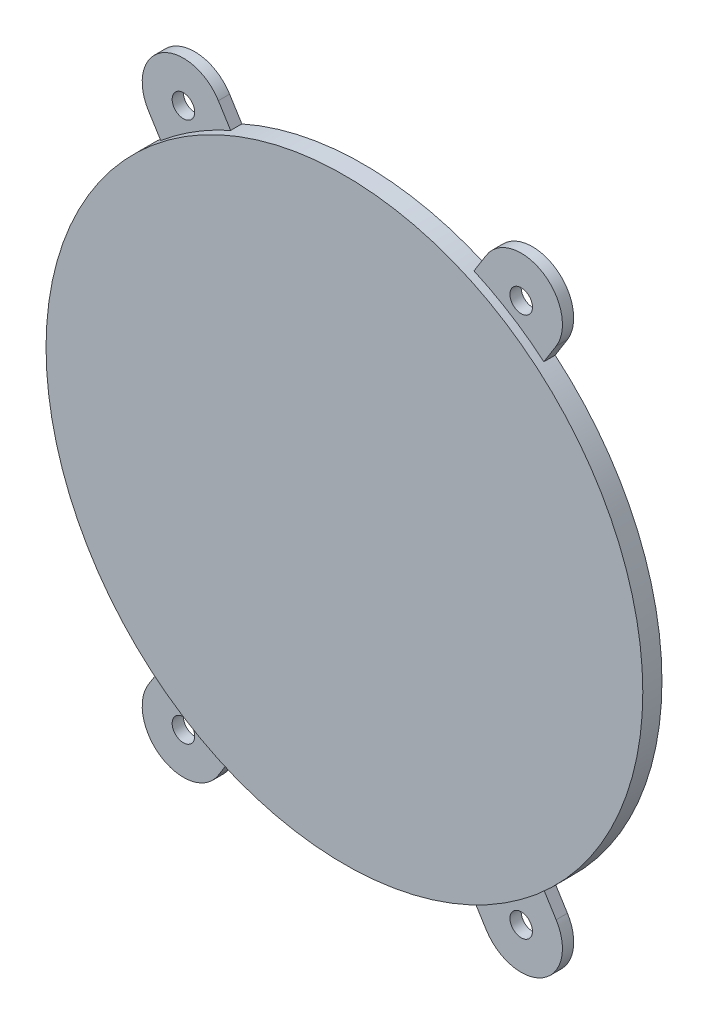
ISO-10303-21;
HEADER;
FILE_DESCRIPTION(('STEP AP214'),'2;1');
FILE_NAME('part.step','',(''),(''),'','','');
FILE_SCHEMA(('AUTOMOTIVE_DESIGN { 1 0 10303 214 1 1 1 1 }'));
ENDSEC;
DATA;
#1=APPLICATION_CONTEXT('core data for automotive mechanical design processes');
#2=APPLICATION_PROTOCOL_DEFINITION('international standard','automotive_design',2000,#1);
#3=PRODUCT_CONTEXT('',#1,'mechanical');
#4=PRODUCT('Part','Part','',(#3));
#5=PRODUCT_RELATED_PRODUCT_CATEGORY('part','',(#4));
#6=PRODUCT_DEFINITION_FORMATION('','',#4);
#7=PRODUCT_DEFINITION_CONTEXT('part definition',#1,'design');
#8=PRODUCT_DEFINITION('design','',#6,#7);
#9=PRODUCT_DEFINITION_SHAPE('','',#8);
#10=(LENGTH_UNIT() NAMED_UNIT(*) SI_UNIT(.MILLI.,.METRE.));
#11=(NAMED_UNIT(*) PLANE_ANGLE_UNIT() SI_UNIT($,.RADIAN.));
#12=(NAMED_UNIT(*) SI_UNIT($,.STERADIAN.) SOLID_ANGLE_UNIT());
#13=UNCERTAINTY_MEASURE_WITH_UNIT(LENGTH_MEASURE(1.E-05),#10,'distance_accuracy_value','');
#14=(GEOMETRIC_REPRESENTATION_CONTEXT(3) GLOBAL_UNCERTAINTY_ASSIGNED_CONTEXT((#13)) GLOBAL_UNIT_ASSIGNED_CONTEXT((#10,
#11,#12)) REPRESENTATION_CONTEXT('',''));
#15=CARTESIAN_POINT('',(0.,0.,0.));
#16=DIRECTION('',(0.,0.,1.));
#17=DIRECTION('',(1.,0.,0.));
#18=AXIS2_PLACEMENT_3D('',#15,#16,#17);
#19=CARTESIAN_POINT('',(0.,0.,1.7));
#20=DIRECTION('',(0.,0.,-1.));
#21=DIRECTION('',(-1.,0.,0.));
#22=AXIS2_PLACEMENT_3D('',#19,#20,#21);
#23=CYLINDRICAL_SURFACE('',#22,26.5);
#24=CARTESIAN_POINT('',(0.,0.,1.7));
#25=DIRECTION('',(0.,0.,1.));
#26=DIRECTION('',(1.,0.,0.));
#27=AXIS2_PLACEMENT_3D('',#24,#25,#26);
#28=CIRCLE('',#27,26.5);
#29=CARTESIAN_POINT('',(26.5,0.,1.7));
#30=VERTEX_POINT('',#29);
#31=EDGE_CURVE('E307',#30,#30,#28,.T.);
#32=ORIENTED_EDGE('',*,*,#31,.F.);
#33=EDGE_LOOP('',(#32));
#34=FACE_BOUND('',#33,.T.);
#35=DIRECTION('',(0.,0.,-1.));
#36=VECTOR('',#35,1.);
#37=CARTESIAN_POINT('',(10.8059111562678,-24.1967411872518,1.7));
#38=LINE('',#37,#36);
#39=CARTESIAN_POINT('',(10.8059111562678,-24.1967411872518,1.));
#40=VERTEX_POINT('',#39);
#41=CARTESIAN_POINT('',(10.8059111562678,-24.1967411872518,0.));
#42=VERTEX_POINT('',#41);
#43=EDGE_CURVE('E103',#40,#42,#38,.T.);
#44=ORIENTED_EDGE('',*,*,#43,.F.);
#45=CARTESIAN_POINT('',(0.,0.,1.));
#46=DIRECTION('',(0.,0.,1.));
#47=DIRECTION('',(1.,0.,0.));
#48=AXIS2_PLACEMENT_3D('',#45,#46,#47);
#49=CIRCLE('',#48,26.5);
#50=CARTESIAN_POINT('',(17.0147051672551,-20.3162449303847,1.));
#51=VERTEX_POINT('',#50);
#52=EDGE_CURVE('E12',#40,#51,#49,.T.);
#53=ORIENTED_EDGE('',*,*,#52,.T.);
#54=DIRECTION('',(0.,0.,-1.));
#55=VECTOR('',#54,1.);
#56=CARTESIAN_POINT('',(17.0147051672551,-20.3162449303847,1.7));
#57=LINE('',#56,#55);
#58=CARTESIAN_POINT('',(17.0147051672551,-20.3162449303847,0.));
#59=VERTEX_POINT('',#58);
#60=EDGE_CURVE('E225',#51,#59,#57,.T.);
#61=ORIENTED_EDGE('',*,*,#60,.T.);
#62=CARTESIAN_POINT('',(0.,0.,0.));
#63=DIRECTION('',(0.,0.,1.));
#64=DIRECTION('',(1.,0.,0.));
#65=AXIS2_PLACEMENT_3D('',#62,#63,#64);
#66=CIRCLE('',#65,26.5);
#67=CARTESIAN_POINT('',(17.0147051672551,20.3162449303847,0.));
#68=VERTEX_POINT('',#67);
#69=EDGE_CURVE('E314',#59,#68,#66,.T.);
#70=ORIENTED_EDGE('',*,*,#69,.T.);
#71=DIRECTION('',(0.,0.,-1.));
#72=VECTOR('',#71,1.);
#73=CARTESIAN_POINT('',(17.0147051672551,20.3162449303847,1.7));
#74=LINE('',#73,#72);
#75=CARTESIAN_POINT('',(17.0147051672551,20.3162449303847,1.));
#76=VERTEX_POINT('',#75);
#77=EDGE_CURVE('E277',#76,#68,#74,.T.);
#78=ORIENTED_EDGE('',*,*,#77,.F.);
#79=CARTESIAN_POINT('',(0.,0.,1.));
#80=DIRECTION('',(0.,0.,1.));
#81=DIRECTION('',(1.,0.,0.));
#82=AXIS2_PLACEMENT_3D('',#79,#80,#81);
#83=CIRCLE('',#82,26.5);
#84=CARTESIAN_POINT('',(10.8059111562678,24.1967411872518,1.));
#85=VERTEX_POINT('',#84);
#86=EDGE_CURVE('E316',#76,#85,#83,.T.);
#87=ORIENTED_EDGE('',*,*,#86,.T.);
#88=DIRECTION('',(0.,0.,-1.));
#89=VECTOR('',#88,1.);
#90=CARTESIAN_POINT('',(10.8059111562678,24.1967411872518,1.7));
#91=LINE('',#90,#89);
#92=CARTESIAN_POINT('',(10.8059111562678,24.1967411872518,0.));
#93=VERTEX_POINT('',#92);
#94=EDGE_CURVE('E266',#85,#93,#91,.T.);
#95=ORIENTED_EDGE('',*,*,#94,.T.);
#96=CARTESIAN_POINT('',(-10.8059111562678,24.1967411872518,0.));
#97=VERTEX_POINT('',#96);
#98=EDGE_CURVE('E306',#93,#97,#66,.T.);
#99=ORIENTED_EDGE('',*,*,#98,.T.);
#100=DIRECTION('',(0.,0.,-1.));
#101=VECTOR('',#100,1.);
#102=CARTESIAN_POINT('',(-10.8059111562678,24.1967411872518,1.7));
#103=LINE('',#102,#101);
#104=CARTESIAN_POINT('',(-10.8059111562678,24.1967411872518,1.));
#105=VERTEX_POINT('',#104);
#106=EDGE_CURVE('E304',#97,#105,#103,.F.);
#107=ORIENTED_EDGE('',*,*,#106,.T.);
#108=CARTESIAN_POINT('',(0.,0.,1.));
#109=DIRECTION('',(0.,0.,1.));
#110=DIRECTION('',(1.,0.,0.));
#111=AXIS2_PLACEMENT_3D('',#108,#109,#110);
#112=CIRCLE('',#111,26.5);
#113=CARTESIAN_POINT('',(-17.0147051672551,20.3162449303847,1.));
#114=VERTEX_POINT('',#113);
#115=EDGE_CURVE('E310',#105,#114,#112,.T.);
#116=ORIENTED_EDGE('',*,*,#115,.T.);
#117=DIRECTION('',(0.,0.,-1.));
#118=VECTOR('',#117,1.);
#119=CARTESIAN_POINT('',(-17.0147051672551,20.3162449303847,1.7));
#120=LINE('',#119,#118);
#121=CARTESIAN_POINT('',(-17.0147051672551,20.3162449303847,0.));
#122=VERTEX_POINT('',#121);
#123=EDGE_CURVE('E301',#122,#114,#120,.F.);
#124=ORIENTED_EDGE('',*,*,#123,.F.);
#125=CARTESIAN_POINT('',(-17.0147051672551,-20.3162449303847,0.));
#126=VERTEX_POINT('',#125);
#127=EDGE_CURVE('E311',#122,#126,#66,.T.);
#128=ORIENTED_EDGE('',*,*,#127,.T.);
#129=DIRECTION('',(0.,0.,-1.));
#130=VECTOR('',#129,1.);
#131=CARTESIAN_POINT('',(-17.0147051672551,-20.3162449303847,1.7));
#132=LINE('',#131,#130);
#133=CARTESIAN_POINT('',(-17.0147051672551,-20.3162449303847,1.));
#134=VERTEX_POINT('',#133);
#135=EDGE_CURVE('E252',#126,#134,#132,.F.);
#136=ORIENTED_EDGE('',*,*,#135,.T.);
#137=CARTESIAN_POINT('',(0.,0.,1.));
#138=DIRECTION('',(0.,0.,1.));
#139=DIRECTION('',(1.,0.,0.));
#140=AXIS2_PLACEMENT_3D('',#137,#138,#139);
#141=CIRCLE('',#140,26.5);
#142=CARTESIAN_POINT('',(-10.8059111562678,-24.1967411872518,1.));
#143=VERTEX_POINT('',#142);
#144=EDGE_CURVE('E93',#134,#143,#141,.T.);
#145=ORIENTED_EDGE('',*,*,#144,.T.);
#146=DIRECTION('',(0.,0.,-1.));
#147=VECTOR('',#146,1.);
#148=CARTESIAN_POINT('',(-10.8059111562678,-24.1967411872518,1.7));
#149=LINE('',#148,#147);
#150=CARTESIAN_POINT('',(-10.8059111562678,-24.1967411872518,0.));
#151=VERTEX_POINT('',#150);
#152=EDGE_CURVE('E243',#151,#143,#149,.F.);
#153=ORIENTED_EDGE('',*,*,#152,.F.);
#154=EDGE_CURVE('E313',#151,#42,#66,.T.);
#155=ORIENTED_EDGE('',*,*,#154,.T.);
#156=EDGE_LOOP('',(#44,#53,#61,#70,#78,#87,#95,#99,#107,#116,#124,#128,#136,#145,#153,#155));
#157=FACE_BOUND('',#156,.T.);
#158=ADVANCED_FACE('F86',(#34,#157),#23,.T.);
#159=CARTESIAN_POINT('',(0.,0.,1.7));
#160=DIRECTION('',(0.,0.,1.));
#161=DIRECTION('',(1.,0.,0.));
#162=AXIS2_PLACEMENT_3D('',#159,#160,#161);
#163=PLANE('',#162);
#164=ORIENTED_EDGE('',*,*,#31,.T.);
#165=EDGE_LOOP('',(#164));
#166=FACE_BOUND('',#165,.T.);
#167=ADVANCED_FACE('F371',(#166),#163,.T.);
#168=CARTESIAN_POINT('',(0.,0.,0.));
#169=DIRECTION('',(0.,0.,1.));
#170=DIRECTION('',(1.,0.,0.));
#171=AXIS2_PLACEMENT_3D('',#168,#169,#170);
#172=PLANE('',#171);
#173=CARTESIAN_POINT('',(-15.,-24.,0.));
#174=DIRECTION('',(0.,0.,1.));
#175=DIRECTION('',(1.,0.,0.));
#176=AXIS2_PLACEMENT_3D('',#173,#174,#175);
#177=CIRCLE('',#176,1.);
#178=CARTESIAN_POINT('',(-14.,-24.,0.));
#179=VERTEX_POINT('',#178);
#180=EDGE_CURVE('E605',#179,#179,#177,.T.);
#181=ORIENTED_EDGE('',*,*,#180,.T.);
#182=EDGE_LOOP('',(#181));
#183=FACE_BOUND('',#182,.T.);
#184=CARTESIAN_POINT('',(15.,-24.,0.));
#185=DIRECTION('',(0.,0.,1.));
#186=DIRECTION('',(1.,0.,0.));
#187=AXIS2_PLACEMENT_3D('',#184,#185,#186);
#188=CIRCLE('',#187,1.);
#189=CARTESIAN_POINT('',(16.,-24.,0.));
#190=VERTEX_POINT('',#189);
#191=EDGE_CURVE('E611',#190,#190,#188,.T.);
#192=ORIENTED_EDGE('',*,*,#191,.T.);
#193=EDGE_LOOP('',(#192));
#194=FACE_BOUND('',#193,.T.);
#195=CARTESIAN_POINT('',(15.,24.,0.));
#196=DIRECTION('',(0.,0.,1.));
#197=DIRECTION('',(1.,0.,0.));
#198=AXIS2_PLACEMENT_3D('',#195,#196,#197);
#199=CIRCLE('',#198,1.);
#200=CARTESIAN_POINT('',(16.,24.,0.));
#201=VERTEX_POINT('',#200);
#202=EDGE_CURVE('E584',#201,#201,#199,.T.);
#203=ORIENTED_EDGE('',*,*,#202,.T.);
#204=EDGE_LOOP('',(#203));
#205=FACE_BOUND('',#204,.T.);
#206=CARTESIAN_POINT('',(-15.,24.,0.));
#207=DIRECTION('',(0.,0.,1.));
#208=DIRECTION('',(1.,0.,0.));
#209=AXIS2_PLACEMENT_3D('',#206,#207,#208);
#210=CIRCLE('',#209,1.);
#211=CARTESIAN_POINT('',(-14.,24.,0.));
#212=VERTEX_POINT('',#211);
#213=EDGE_CURVE('E580',#212,#212,#210,.T.);
#214=ORIENTED_EDGE('',*,*,#213,.T.);
#215=EDGE_LOOP('',(#214));
#216=FACE_BOUND('',#215,.T.);
#217=ORIENTED_EDGE('',*,*,#69,.F.);
#218=DIRECTION('',(0.52999894000318,-0.847998304005088,0.));
#219=VECTOR('',#218,1.);
#220=CARTESIAN_POINT('',(3.10439700549366,1.94024812843354,0.));
#221=LINE('',#220,#219);
#222=CARTESIAN_POINT('',(18.1043970054937,-22.0597518715665,0.));
#223=VERTEX_POINT('',#222);
#224=EDGE_CURVE('E211',#59,#223,#221,.T.);
#225=ORIENTED_EDGE('',*,*,#224,.T.);
#226=CARTESIAN_POINT('',(15.,-24.,0.));
#227=DIRECTION('',(0.,0.,1.));
#228=DIRECTION('',(1.,0.,0.));
#229=AXIS2_PLACEMENT_3D('',#226,#227,#228);
#230=CIRCLE('',#229,3.66085284703003);
#231=CARTESIAN_POINT('',(11.8956029945063,-25.9402481284335,0.));
#232=VERTEX_POINT('',#231);
#233=EDGE_CURVE('E218',#232,#223,#230,.T.);
#234=ORIENTED_EDGE('',*,*,#233,.F.);
#235=DIRECTION('',(0.52999894000318,-0.847998304005088,0.));
#236=VECTOR('',#235,1.);
#237=CARTESIAN_POINT('',(-3.10439700549366,-1.94024812843354,0.));
#238=LINE('',#237,#236);
#239=EDGE_CURVE('E215',#42,#232,#238,.T.);
#240=ORIENTED_EDGE('',*,*,#239,.F.);
#241=ORIENTED_EDGE('',*,*,#154,.F.);
#242=DIRECTION('',(0.52999894000318,0.847998304005088,0.));
#243=VECTOR('',#242,1.);
#244=CARTESIAN_POINT('',(3.10439700549366,-1.94024812843354,0.));
#245=LINE('',#244,#243);
#246=CARTESIAN_POINT('',(-11.8956029945063,-25.9402481284335,0.));
#247=VERTEX_POINT('',#246);
#248=EDGE_CURVE('E231',#247,#151,#245,.T.);
#249=ORIENTED_EDGE('',*,*,#248,.F.);
#250=CARTESIAN_POINT('',(-15.,-24.,0.));
#251=DIRECTION('',(0.,0.,1.));
#252=DIRECTION('',(1.,0.,0.));
#253=AXIS2_PLACEMENT_3D('',#250,#251,#252);
#254=CIRCLE('',#253,3.66085284703003);
#255=CARTESIAN_POINT('',(-18.1043970054937,-22.0597518715665,0.));
#256=VERTEX_POINT('',#255);
#257=EDGE_CURVE('E232',#256,#247,#254,.T.);
#258=ORIENTED_EDGE('',*,*,#257,.F.);
#259=DIRECTION('',(0.52999894000318,0.847998304005088,0.));
#260=VECTOR('',#259,1.);
#261=CARTESIAN_POINT('',(-3.10439700549366,1.94024812843354,0.));
#262=LINE('',#261,#260);
#263=EDGE_CURVE('E240',#256,#126,#262,.T.);
#264=ORIENTED_EDGE('',*,*,#263,.T.);
#265=ORIENTED_EDGE('',*,*,#127,.F.);
#266=DIRECTION('',(0.52999894000318,-0.847998304005088,0.));
#267=VECTOR('',#266,1.);
#268=CARTESIAN_POINT('',(-3.10439700549366,-1.94024812843354,0.));
#269=LINE('',#268,#267);
#270=CARTESIAN_POINT('',(-18.1043970054937,22.0597518715665,0.));
#271=VERTEX_POINT('',#270);
#272=EDGE_CURVE('E285',#271,#122,#269,.T.);
#273=ORIENTED_EDGE('',*,*,#272,.F.);
#274=CARTESIAN_POINT('',(-15.,24.,0.));
#275=DIRECTION('',(0.,0.,1.));
#276=DIRECTION('',(1.,0.,0.));
#277=AXIS2_PLACEMENT_3D('',#274,#275,#276);
#278=CIRCLE('',#277,3.66085284703003);
#279=CARTESIAN_POINT('',(-11.8956029945063,25.9402481284335,0.));
#280=VERTEX_POINT('',#279);
#281=EDGE_CURVE('E293',#280,#271,#278,.T.);
#282=ORIENTED_EDGE('',*,*,#281,.F.);
#283=DIRECTION('',(0.52999894000318,-0.847998304005088,0.));
#284=VECTOR('',#283,1.);
#285=CARTESIAN_POINT('',(3.10439700549366,1.94024812843354,0.));
#286=LINE('',#285,#284);
#287=EDGE_CURVE('E280',#280,#97,#286,.T.);
#288=ORIENTED_EDGE('',*,*,#287,.T.);
#289=ORIENTED_EDGE('',*,*,#98,.F.);
#290=DIRECTION('',(0.52999894000318,0.847998304005088,0.));
#291=VECTOR('',#290,1.);
#292=CARTESIAN_POINT('',(-3.10439700549366,1.94024812843354,0.));
#293=LINE('',#292,#291);
#294=CARTESIAN_POINT('',(11.8956029945063,25.9402481284335,0.));
#295=VERTEX_POINT('',#294);
#296=EDGE_CURVE('E264',#93,#295,#293,.T.);
#297=ORIENTED_EDGE('',*,*,#296,.T.);
#298=CARTESIAN_POINT('',(15.,24.,0.));
#299=DIRECTION('',(0.,0.,1.));
#300=DIRECTION('',(1.,0.,0.));
#301=AXIS2_PLACEMENT_3D('',#298,#299,#300);
#302=CIRCLE('',#301,3.66085284703003);
#303=CARTESIAN_POINT('',(18.1043970054937,22.0597518715665,0.));
#304=VERTEX_POINT('',#303);
#305=EDGE_CURVE('E259',#304,#295,#302,.T.);
#306=ORIENTED_EDGE('',*,*,#305,.F.);
#307=DIRECTION('',(0.52999894000318,0.847998304005088,0.));
#308=VECTOR('',#307,1.);
#309=CARTESIAN_POINT('',(3.10439700549366,-1.94024812843354,0.));
#310=LINE('',#309,#308);
#311=EDGE_CURVE('E254',#68,#304,#310,.T.);
#312=ORIENTED_EDGE('',*,*,#311,.F.);
#313=EDGE_LOOP('',(#217,#225,#234,#240,#241,#249,#258,#264,#265,#273,#282,#288,#289,#297,#306,#312));
#314=FACE_BOUND('',#313,.T.);
#315=ADVANCED_FACE('F333',(#183,#194,#205,#216,#314),#172,.F.);
#316=CARTESIAN_POINT('',(3.10439700549366,1.94024812843354,1.));
#317=DIRECTION('',(0.847998304005088,0.52999894000318,0.));
#318=DIRECTION('',(-0.52999894000318,0.847998304005088,0.));
#319=AXIS2_PLACEMENT_3D('',#316,#317,#318);
#320=PLANE('',#319);
#321=ORIENTED_EDGE('',*,*,#106,.F.);
#322=ORIENTED_EDGE('',*,*,#287,.F.);
#323=DIRECTION('',(0.,0.,-1.));
#324=VECTOR('',#323,1.);
#325=CARTESIAN_POINT('',(-11.8956029945063,25.9402481284335,1.));
#326=LINE('',#325,#324);
#327=CARTESIAN_POINT('',(-11.8956029945063,25.9402481284335,1.));
#328=VERTEX_POINT('',#327);
#329=EDGE_CURVE('E299',#328,#280,#326,.T.);
#330=ORIENTED_EDGE('',*,*,#329,.F.);
#331=DIRECTION('',(0.52999894000318,-0.847998304005088,0.));
#332=VECTOR('',#331,1.);
#333=CARTESIAN_POINT('',(3.10439700549366,1.94024812843354,1.));
#334=LINE('',#333,#332);
#335=EDGE_CURVE('E281',#328,#105,#334,.T.);
#336=ORIENTED_EDGE('',*,*,#335,.T.);
#337=EDGE_LOOP('',(#321,#322,#330,#336));
#338=FACE_BOUND('',#337,.T.);
#339=ADVANCED_FACE('F341',(#338),#320,.T.);
#340=CARTESIAN_POINT('',(-3.10439700549366,-1.94024812843354,1.));
#341=DIRECTION('',(0.847998304005088,0.52999894000318,0.));
#342=DIRECTION('',(-0.52999894000318,0.847998304005088,0.));
#343=AXIS2_PLACEMENT_3D('',#340,#341,#342);
#344=PLANE('',#343);
#345=ORIENTED_EDGE('',*,*,#272,.T.);
#346=ORIENTED_EDGE('',*,*,#123,.T.);
#347=DIRECTION('',(0.52999894000318,-0.847998304005088,0.));
#348=VECTOR('',#347,1.);
#349=CARTESIAN_POINT('',(-3.10439700549366,-1.94024812843354,1.));
#350=LINE('',#349,#348);
#351=CARTESIAN_POINT('',(-18.1043970054937,22.0597518715665,1.));
#352=VERTEX_POINT('',#351);
#353=EDGE_CURVE('E287',#352,#114,#350,.T.);
#354=ORIENTED_EDGE('',*,*,#353,.F.);
#355=DIRECTION('',(0.,0.,-1.));
#356=VECTOR('',#355,1.);
#357=CARTESIAN_POINT('',(-18.1043970054937,22.0597518715665,1.));
#358=LINE('',#357,#356);
#359=EDGE_CURVE('E290',#352,#271,#358,.T.);
#360=ORIENTED_EDGE('',*,*,#359,.T.);
#361=EDGE_LOOP('',(#345,#346,#354,#360));
#362=FACE_BOUND('',#361,.T.);
#363=ADVANCED_FACE('F351',(#362),#344,.F.);
#364=CARTESIAN_POINT('',(-15.,24.,1.));
#365=DIRECTION('',(0.,0.,-1.));
#366=DIRECTION('',(-1.,0.,0.));
#367=AXIS2_PLACEMENT_3D('',#364,#365,#366);
#368=CYLINDRICAL_SURFACE('',#367,3.66085284703003);
#369=ORIENTED_EDGE('',*,*,#281,.T.);
#370=ORIENTED_EDGE('',*,*,#359,.F.);
#371=CARTESIAN_POINT('',(-15.,24.,1.));
#372=DIRECTION('',(0.,0.,1.));
#373=DIRECTION('',(1.,0.,0.));
#374=AXIS2_PLACEMENT_3D('',#371,#372,#373);
#375=CIRCLE('',#374,3.66085284703003);
#376=EDGE_CURVE('E284',#328,#352,#375,.T.);
#377=ORIENTED_EDGE('',*,*,#376,.F.);
#378=ORIENTED_EDGE('',*,*,#329,.T.);
#379=EDGE_LOOP('',(#369,#370,#377,#378));
#380=FACE_BOUND('',#379,.T.);
#381=ADVANCED_FACE('F347',(#380),#368,.T.);
#382=CARTESIAN_POINT('',(0.,0.,1.));
#383=DIRECTION('',(0.,0.,1.));
#384=DIRECTION('',(1.,0.,0.));
#385=AXIS2_PLACEMENT_3D('',#382,#383,#384);
#386=PLANE('',#385);
#387=CARTESIAN_POINT('',(-15.,24.,1.));
#388=DIRECTION('',(0.,0.,1.));
#389=DIRECTION('',(1.,0.,0.));
#390=AXIS2_PLACEMENT_3D('',#387,#388,#389);
#391=CIRCLE('',#390,1.);
#392=CARTESIAN_POINT('',(-14.,24.,1.));
#393=VERTEX_POINT('',#392);
#394=EDGE_CURVE('E583',#393,#393,#391,.T.);
#395=ORIENTED_EDGE('',*,*,#394,.F.);
#396=EDGE_LOOP('',(#395));
#397=FACE_BOUND('',#396,.T.);
#398=ORIENTED_EDGE('',*,*,#115,.F.);
#399=ORIENTED_EDGE('',*,*,#335,.F.);
#400=ORIENTED_EDGE('',*,*,#376,.T.);
#401=ORIENTED_EDGE('',*,*,#353,.T.);
#402=EDGE_LOOP('',(#398,#399,#400,#401));
#403=FACE_BOUND('',#402,.T.);
#404=ADVANCED_FACE('F354',(#397,#403),#386,.T.);
#405=CARTESIAN_POINT('',(3.10439700549366,-1.94024812843354,1.));
#406=DIRECTION('',(-0.847998304005088,0.52999894000318,0.));
#407=DIRECTION('',(-0.52999894000318,-0.847998304005088,0.));
#408=AXIS2_PLACEMENT_3D('',#405,#406,#407);
#409=PLANE('',#408);
#410=DIRECTION('',(0.52999894000318,0.847998304005088,0.));
#411=VECTOR('',#410,1.);
#412=CARTESIAN_POINT('',(3.10439700549366,-1.94024812843354,1.));
#413=LINE('',#412,#411);
#414=CARTESIAN_POINT('',(18.1043970054937,22.0597518715665,1.));
#415=VERTEX_POINT('',#414);
#416=EDGE_CURVE('E263',#76,#415,#413,.T.);
#417=ORIENTED_EDGE('',*,*,#416,.F.);
#418=ORIENTED_EDGE('',*,*,#77,.T.);
#419=ORIENTED_EDGE('',*,*,#311,.T.);
#420=DIRECTION('',(0.,0.,-1.));
#421=VECTOR('',#420,1.);
#422=CARTESIAN_POINT('',(18.1043970054937,22.0597518715665,1.));
#423=LINE('',#422,#421);
#424=EDGE_CURVE('E255',#415,#304,#423,.T.);
#425=ORIENTED_EDGE('',*,*,#424,.F.);
#426=EDGE_LOOP('',(#417,#418,#419,#425));
#427=FACE_BOUND('',#426,.T.);
#428=ADVANCED_FACE('F391',(#427),#409,.F.);
#429=CARTESIAN_POINT('',(-3.10439700549366,1.94024812843354,1.));
#430=DIRECTION('',(-0.847998304005088,0.52999894000318,0.));
#431=DIRECTION('',(-0.52999894000318,-0.847998304005088,0.));
#432=AXIS2_PLACEMENT_3D('',#429,#430,#431);
#433=PLANE('',#432);
#434=ORIENTED_EDGE('',*,*,#94,.F.);
#435=DIRECTION('',(0.52999894000318,0.847998304005088,0.));
#436=VECTOR('',#435,1.);
#437=CARTESIAN_POINT('',(-3.10439700549366,1.94024812843354,1.));
#438=LINE('',#437,#436);
#439=CARTESIAN_POINT('',(11.8956029945063,25.9402481284335,1.));
#440=VERTEX_POINT('',#439);
#441=EDGE_CURVE('E258',#85,#440,#438,.T.);
#442=ORIENTED_EDGE('',*,*,#441,.T.);
#443=DIRECTION('',(0.,0.,-1.));
#444=VECTOR('',#443,1.);
#445=CARTESIAN_POINT('',(11.8956029945063,25.9402481284335,1.));
#446=LINE('',#445,#444);
#447=EDGE_CURVE('E260',#440,#295,#446,.T.);
#448=ORIENTED_EDGE('',*,*,#447,.T.);
#449=ORIENTED_EDGE('',*,*,#296,.F.);
#450=EDGE_LOOP('',(#434,#442,#448,#449));
#451=FACE_BOUND('',#450,.T.);
#452=ADVANCED_FACE('F394',(#451),#433,.T.);
#453=CARTESIAN_POINT('',(15.,24.,1.));
#454=DIRECTION('',(0.,0.,-1.));
#455=DIRECTION('',(-1.,0.,0.));
#456=AXIS2_PLACEMENT_3D('',#453,#454,#455);
#457=CYLINDRICAL_SURFACE('',#456,3.66085284703003);
#458=ORIENTED_EDGE('',*,*,#305,.T.);
#459=ORIENTED_EDGE('',*,*,#447,.F.);
#460=CARTESIAN_POINT('',(15.,24.,1.));
#461=DIRECTION('',(0.,0.,1.));
#462=DIRECTION('',(1.,0.,0.));
#463=AXIS2_PLACEMENT_3D('',#460,#461,#462);
#464=CIRCLE('',#463,3.66085284703003);
#465=EDGE_CURVE('E267',#415,#440,#464,.T.);
#466=ORIENTED_EDGE('',*,*,#465,.F.);
#467=ORIENTED_EDGE('',*,*,#424,.T.);
#468=EDGE_LOOP('',(#458,#459,#466,#467));
#469=FACE_BOUND('',#468,.T.);
#470=ADVANCED_FACE('F365',(#469),#457,.T.);
#471=CARTESIAN_POINT('',(0.,0.,1.));
#472=DIRECTION('',(0.,0.,1.));
#473=DIRECTION('',(1.,0.,0.));
#474=AXIS2_PLACEMENT_3D('',#471,#472,#473);
#475=PLANE('',#474);
#476=CARTESIAN_POINT('',(15.,24.,1.));
#477=DIRECTION('',(0.,0.,1.));
#478=DIRECTION('',(1.,0.,0.));
#479=AXIS2_PLACEMENT_3D('',#476,#477,#478);
#480=CIRCLE('',#479,1.);
#481=CARTESIAN_POINT('',(16.,24.,1.));
#482=VERTEX_POINT('',#481);
#483=EDGE_CURVE('E588',#482,#482,#480,.T.);
#484=ORIENTED_EDGE('',*,*,#483,.F.);
#485=EDGE_LOOP('',(#484));
#486=FACE_BOUND('',#485,.T.);
#487=ORIENTED_EDGE('',*,*,#86,.F.);
#488=ORIENTED_EDGE('',*,*,#416,.T.);
#489=ORIENTED_EDGE('',*,*,#465,.T.);
#490=ORIENTED_EDGE('',*,*,#441,.F.);
#491=EDGE_LOOP('',(#487,#488,#489,#490));
#492=FACE_BOUND('',#491,.T.);
#493=ADVANCED_FACE('F358',(#486,#492),#475,.T.);
#494=CARTESIAN_POINT('',(-3.10439700549366,1.94024812843354,1.));
#495=DIRECTION('',(-0.847998304005088,0.52999894000318,0.));
#496=DIRECTION('',(-0.52999894000318,-0.847998304005088,0.));
#497=AXIS2_PLACEMENT_3D('',#494,#495,#496);
#498=PLANE('',#497);
#499=ORIENTED_EDGE('',*,*,#135,.F.);
#500=ORIENTED_EDGE('',*,*,#263,.F.);
#501=DIRECTION('',(0.,0.,-1.));
#502=VECTOR('',#501,1.);
#503=CARTESIAN_POINT('',(-18.1043970054937,-22.0597518715665,1.));
#504=LINE('',#503,#502);
#505=CARTESIAN_POINT('',(-18.1043970054937,-22.0597518715665,1.));
#506=VERTEX_POINT('',#505);
#507=EDGE_CURVE('E229',#506,#256,#504,.T.);
#508=ORIENTED_EDGE('',*,*,#507,.F.);
#509=DIRECTION('',(0.52999894000318,0.847998304005088,0.));
#510=VECTOR('',#509,1.);
#511=CARTESIAN_POINT('',(-3.10439700549366,1.94024812843354,1.));
#512=LINE('',#511,#510);
#513=EDGE_CURVE('E228',#506,#134,#512,.T.);
#514=ORIENTED_EDGE('',*,*,#513,.T.);
#515=EDGE_LOOP('',(#499,#500,#508,#514));
#516=FACE_BOUND('',#515,.T.);
#517=ADVANCED_FACE('F356',(#516),#498,.T.);
#518=CARTESIAN_POINT('',(3.10439700549366,-1.94024812843354,1.));
#519=DIRECTION('',(-0.847998304005088,0.52999894000318,0.));
#520=DIRECTION('',(-0.52999894000318,-0.847998304005088,0.));
#521=AXIS2_PLACEMENT_3D('',#518,#519,#520);
#522=PLANE('',#521);
#523=ORIENTED_EDGE('',*,*,#248,.T.);
#524=ORIENTED_EDGE('',*,*,#152,.T.);
#525=DIRECTION('',(0.52999894000318,0.847998304005088,0.));
#526=VECTOR('',#525,1.);
#527=CARTESIAN_POINT('',(3.10439700549366,-1.94024812843354,1.));
#528=LINE('',#527,#526);
#529=CARTESIAN_POINT('',(-11.8956029945063,-25.9402481284335,1.));
#530=VERTEX_POINT('',#529);
#531=EDGE_CURVE('E244',#530,#143,#528,.T.);
#532=ORIENTED_EDGE('',*,*,#531,.F.);
#533=DIRECTION('',(0.,0.,-1.));
#534=VECTOR('',#533,1.);
#535=CARTESIAN_POINT('',(-11.8956029945063,-25.9402481284335,1.));
#536=LINE('',#535,#534);
#537=EDGE_CURVE('E233',#530,#247,#536,.T.);
#538=ORIENTED_EDGE('',*,*,#537,.T.);
#539=EDGE_LOOP('',(#523,#524,#532,#538));
#540=FACE_BOUND('',#539,.T.);
#541=ADVANCED_FACE('F324',(#540),#522,.F.);
#542=CARTESIAN_POINT('',(-15.,-24.,1.));
#543=DIRECTION('',(0.,0.,-1.));
#544=DIRECTION('',(-1.,0.,0.));
#545=AXIS2_PLACEMENT_3D('',#542,#543,#544);
#546=CYLINDRICAL_SURFACE('',#545,3.66085284703003);
#547=ORIENTED_EDGE('',*,*,#257,.T.);
#548=ORIENTED_EDGE('',*,*,#537,.F.);
#549=CARTESIAN_POINT('',(-15.,-24.,1.));
#550=DIRECTION('',(0.,0.,1.));
#551=DIRECTION('',(1.,0.,0.));
#552=AXIS2_PLACEMENT_3D('',#549,#550,#551);
#553=CIRCLE('',#552,3.66085284703003);
#554=EDGE_CURVE('E236',#506,#530,#553,.T.);
#555=ORIENTED_EDGE('',*,*,#554,.F.);
#556=ORIENTED_EDGE('',*,*,#507,.T.);
#557=EDGE_LOOP('',(#547,#548,#555,#556));
#558=FACE_BOUND('',#557,.T.);
#559=ADVANCED_FACE('F330',(#558),#546,.T.);
#560=CARTESIAN_POINT('',(0.,0.,1.));
#561=DIRECTION('',(0.,0.,1.));
#562=DIRECTION('',(1.,0.,0.));
#563=AXIS2_PLACEMENT_3D('',#560,#561,#562);
#564=PLANE('',#563);
#565=CARTESIAN_POINT('',(-15.,-24.,1.));
#566=DIRECTION('',(0.,0.,1.));
#567=DIRECTION('',(1.,0.,0.));
#568=AXIS2_PLACEMENT_3D('',#565,#566,#567);
#569=CIRCLE('',#568,1.);
#570=CARTESIAN_POINT('',(-14.,-24.,1.));
#571=VERTEX_POINT('',#570);
#572=EDGE_CURVE('E602',#571,#571,#569,.T.);
#573=ORIENTED_EDGE('',*,*,#572,.F.);
#574=EDGE_LOOP('',(#573));
#575=FACE_BOUND('',#574,.T.);
#576=ORIENTED_EDGE('',*,*,#144,.F.);
#577=ORIENTED_EDGE('',*,*,#513,.F.);
#578=ORIENTED_EDGE('',*,*,#554,.T.);
#579=ORIENTED_EDGE('',*,*,#531,.T.);
#580=EDGE_LOOP('',(#576,#577,#578,#579));
#581=FACE_BOUND('',#580,.T.);
#582=ADVANCED_FACE('F326',(#575,#581),#564,.T.);
#583=CARTESIAN_POINT('',(-3.10439700549366,-1.94024812843354,1.));
#584=DIRECTION('',(0.847998304005088,0.52999894000318,0.));
#585=DIRECTION('',(-0.52999894000318,0.847998304005088,0.));
#586=AXIS2_PLACEMENT_3D('',#583,#584,#585);
#587=PLANE('',#586);
#588=DIRECTION('',(0.52999894000318,-0.847998304005088,0.));
#589=VECTOR('',#588,1.);
#590=CARTESIAN_POINT('',(-3.10439700549366,-1.94024812843354,1.));
#591=LINE('',#590,#589);
#592=CARTESIAN_POINT('',(11.8956029945063,-25.9402481284335,1.));
#593=VERTEX_POINT('',#592);
#594=EDGE_CURVE('E195',#40,#593,#591,.T.);
#595=ORIENTED_EDGE('',*,*,#594,.F.);
#596=ORIENTED_EDGE('',*,*,#43,.T.);
#597=ORIENTED_EDGE('',*,*,#239,.T.);
#598=DIRECTION('',(0.,0.,-1.));
#599=VECTOR('',#598,1.);
#600=CARTESIAN_POINT('',(11.8956029945063,-25.9402481284335,1.));
#601=LINE('',#600,#599);
#602=EDGE_CURVE('E209',#593,#232,#601,.T.);
#603=ORIENTED_EDGE('',*,*,#602,.F.);
#604=EDGE_LOOP('',(#595,#596,#597,#603));
#605=FACE_BOUND('',#604,.T.);
#606=ADVANCED_FACE('F213',(#605),#587,.F.);
#607=CARTESIAN_POINT('',(3.10439700549366,1.94024812843354,1.));
#608=DIRECTION('',(0.847998304005088,0.52999894000318,0.));
#609=DIRECTION('',(-0.52999894000318,0.847998304005088,0.));
#610=AXIS2_PLACEMENT_3D('',#607,#608,#609);
#611=PLANE('',#610);
#612=ORIENTED_EDGE('',*,*,#60,.F.);
#613=DIRECTION('',(0.52999894000318,-0.847998304005088,0.));
#614=VECTOR('',#613,1.);
#615=CARTESIAN_POINT('',(3.10439700549366,1.94024812843354,1.));
#616=LINE('',#615,#614);
#617=CARTESIAN_POINT('',(18.1043970054937,-22.0597518715665,1.));
#618=VERTEX_POINT('',#617);
#619=EDGE_CURVE('E217',#51,#618,#616,.T.);
#620=ORIENTED_EDGE('',*,*,#619,.T.);
#621=DIRECTION('',(0.,0.,-1.));
#622=VECTOR('',#621,1.);
#623=CARTESIAN_POINT('',(18.1043970054937,-22.0597518715665,1.));
#624=LINE('',#623,#622);
#625=EDGE_CURVE('E203',#618,#223,#624,.T.);
#626=ORIENTED_EDGE('',*,*,#625,.T.);
#627=ORIENTED_EDGE('',*,*,#224,.F.);
#628=EDGE_LOOP('',(#612,#620,#626,#627));
#629=FACE_BOUND('',#628,.T.);
#630=ADVANCED_FACE('F423',(#629),#611,.T.);
#631=CARTESIAN_POINT('',(15.,-24.,1.));
#632=DIRECTION('',(0.,0.,-1.));
#633=DIRECTION('',(-1.,0.,0.));
#634=AXIS2_PLACEMENT_3D('',#631,#632,#633);
#635=CYLINDRICAL_SURFACE('',#634,3.66085284703003);
#636=ORIENTED_EDGE('',*,*,#233,.T.);
#637=ORIENTED_EDGE('',*,*,#625,.F.);
#638=CARTESIAN_POINT('',(15.,-24.,1.));
#639=DIRECTION('',(0.,0.,1.));
#640=DIRECTION('',(1.,0.,0.));
#641=AXIS2_PLACEMENT_3D('',#638,#639,#640);
#642=CIRCLE('',#641,3.66085284703003);
#643=EDGE_CURVE('E199',#593,#618,#642,.T.);
#644=ORIENTED_EDGE('',*,*,#643,.F.);
#645=ORIENTED_EDGE('',*,*,#602,.T.);
#646=EDGE_LOOP('',(#636,#637,#644,#645));
#647=FACE_BOUND('',#646,.T.);
#648=ADVANCED_FACE('F208',(#647),#635,.T.);
#649=CARTESIAN_POINT('',(0.,0.,1.));
#650=DIRECTION('',(0.,0.,1.));
#651=DIRECTION('',(1.,0.,0.));
#652=AXIS2_PLACEMENT_3D('',#649,#650,#651);
#653=PLANE('',#652);
#654=CARTESIAN_POINT('',(15.,-24.,1.));
#655=DIRECTION('',(0.,0.,1.));
#656=DIRECTION('',(1.,0.,0.));
#657=AXIS2_PLACEMENT_3D('',#654,#655,#656);
#658=CIRCLE('',#657,1.);
#659=CARTESIAN_POINT('',(16.,-24.,1.));
#660=VERTEX_POINT('',#659);
#661=EDGE_CURVE('E608',#660,#660,#658,.T.);
#662=ORIENTED_EDGE('',*,*,#661,.F.);
#663=EDGE_LOOP('',(#662));
#664=FACE_BOUND('',#663,.T.);
#665=ORIENTED_EDGE('',*,*,#52,.F.);
#666=ORIENTED_EDGE('',*,*,#594,.T.);
#667=ORIENTED_EDGE('',*,*,#643,.T.);
#668=ORIENTED_EDGE('',*,*,#619,.F.);
#669=EDGE_LOOP('',(#665,#666,#667,#668));
#670=FACE_BOUND('',#669,.T.);
#671=ADVANCED_FACE('F197',(#664,#670),#653,.T.);
#672=CARTESIAN_POINT('',(15.,-24.,0.));
#673=DIRECTION('',(0.,0.,1.));
#674=DIRECTION('',(1.,0.,0.));
#675=AXIS2_PLACEMENT_3D('',#672,#673,#674);
#676=CYLINDRICAL_SURFACE('',#675,1.);
#677=ORIENTED_EDGE('',*,*,#191,.F.);
#678=EDGE_LOOP('',(#677));
#679=FACE_BOUND('',#678,.T.);
#680=ORIENTED_EDGE('',*,*,#661,.T.);
#681=EDGE_LOOP('',(#680));
#682=FACE_BOUND('',#681,.T.);
#683=ADVANCED_FACE('F442',(#679,#682),#676,.F.);
#684=CARTESIAN_POINT('',(-15.,-24.,0.));
#685=DIRECTION('',(0.,0.,1.));
#686=DIRECTION('',(1.,0.,0.));
#687=AXIS2_PLACEMENT_3D('',#684,#685,#686);
#688=CYLINDRICAL_SURFACE('',#687,1.);
#689=ORIENTED_EDGE('',*,*,#180,.F.);
#690=EDGE_LOOP('',(#689));
#691=FACE_BOUND('',#690,.T.);
#692=ORIENTED_EDGE('',*,*,#572,.T.);
#693=EDGE_LOOP('',(#692));
#694=FACE_BOUND('',#693,.T.);
#695=ADVANCED_FACE('F450',(#691,#694),#688,.F.);
#696=CARTESIAN_POINT('',(15.,24.,0.));
#697=DIRECTION('',(0.,0.,1.));
#698=DIRECTION('',(1.,0.,0.));
#699=AXIS2_PLACEMENT_3D('',#696,#697,#698);
#700=CYLINDRICAL_SURFACE('',#699,1.);
#701=ORIENTED_EDGE('',*,*,#202,.F.);
#702=EDGE_LOOP('',(#701));
#703=FACE_BOUND('',#702,.T.);
#704=ORIENTED_EDGE('',*,*,#483,.T.);
#705=EDGE_LOOP('',(#704));
#706=FACE_BOUND('',#705,.T.);
#707=ADVANCED_FACE('F458',(#703,#706),#700,.F.);
#708=CARTESIAN_POINT('',(-15.,24.,0.));
#709=DIRECTION('',(0.,0.,1.));
#710=DIRECTION('',(1.,0.,0.));
#711=AXIS2_PLACEMENT_3D('',#708,#709,#710);
#712=CYLINDRICAL_SURFACE('',#711,1.);
#713=ORIENTED_EDGE('',*,*,#213,.F.);
#714=EDGE_LOOP('',(#713));
#715=FACE_BOUND('',#714,.T.);
#716=ORIENTED_EDGE('',*,*,#394,.T.);
#717=EDGE_LOOP('',(#716));
#718=FACE_BOUND('',#717,.T.);
#719=ADVANCED_FACE('F466',(#715,#718),#712,.F.);
#720=CLOSED_SHELL('',(#158,#167,#315,#339,#363,#381,#404,#428,#452,#470,#493,#517,#541,#559,
#582,#606,#630,#648,#671,#683,#695,#707,#719));
#721=MANIFOLD_SOLID_BREP('B2',#720);
#722=ADVANCED_BREP_SHAPE_REPRESENTATION('',(#18,#721),#14);
#723=SHAPE_DEFINITION_REPRESENTATION(#9,#722);
ENDSEC;
END-ISO-10303-21;
